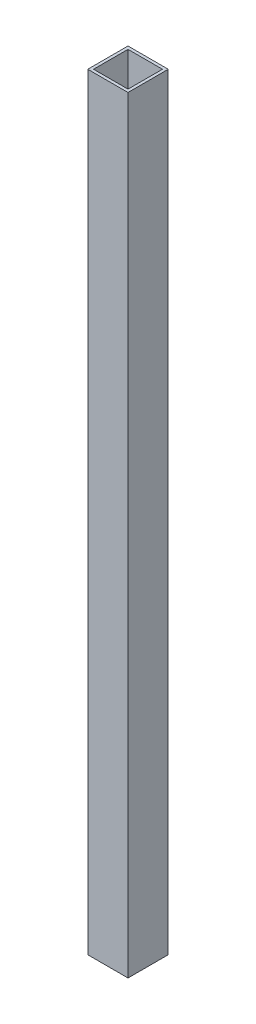
ISO-10303-21;
HEADER;
FILE_DESCRIPTION(('STEP AP214'),'2;1');
FILE_NAME('part.step','',(''),(''),'','','');
FILE_SCHEMA(('AUTOMOTIVE_DESIGN { 1 0 10303 214 1 1 1 1 }'));
ENDSEC;
DATA;
#1=APPLICATION_CONTEXT('core data for automotive mechanical design processes');
#2=APPLICATION_PROTOCOL_DEFINITION('international standard','automotive_design',2000,#1);
#3=PRODUCT_CONTEXT('',#1,'mechanical');
#4=PRODUCT('Part','Part','',(#3));
#5=PRODUCT_RELATED_PRODUCT_CATEGORY('part','',(#4));
#6=PRODUCT_DEFINITION_FORMATION('','',#4);
#7=PRODUCT_DEFINITION_CONTEXT('part definition',#1,'design');
#8=PRODUCT_DEFINITION('design','',#6,#7);
#9=PRODUCT_DEFINITION_SHAPE('','',#8);
#10=(LENGTH_UNIT() NAMED_UNIT(*) SI_UNIT(.MILLI.,.METRE.));
#11=(NAMED_UNIT(*) PLANE_ANGLE_UNIT() SI_UNIT($,.RADIAN.));
#12=(NAMED_UNIT(*) SI_UNIT($,.STERADIAN.) SOLID_ANGLE_UNIT());
#13=UNCERTAINTY_MEASURE_WITH_UNIT(LENGTH_MEASURE(1.E-05),#10,'distance_accuracy_value','');
#14=(GEOMETRIC_REPRESENTATION_CONTEXT(3) GLOBAL_UNCERTAINTY_ASSIGNED_CONTEXT((#13)) GLOBAL_UNIT_ASSIGNED_CONTEXT((#10,
#11,#12)) REPRESENTATION_CONTEXT('',''));
#15=CARTESIAN_POINT('',(0.,0.,0.));
#16=DIRECTION('',(0.,0.,1.));
#17=DIRECTION('',(1.,0.,0.));
#18=AXIS2_PLACEMENT_3D('',#15,#16,#17);
#19=CARTESIAN_POINT('',(401.427112483978,-847.1408,-209.294155168534));
#20=DIRECTION('',(0.,0.,1.));
#21=DIRECTION('',(1.,0.,0.));
#22=AXIS2_PLACEMENT_3D('',#19,#20,#21);
#23=PLANE('',#22);
#24=DIRECTION('',(1.,0.,0.));
#25=VECTOR('',#24,1.);
#26=CARTESIAN_POINT('',(401.427112483978,0.,-209.294155168534));
#27=LINE('',#26,#25);
#28=CARTESIAN_POINT('',(379.202112483979,0.,-209.294155168534));
#29=VERTEX_POINT('',#28);
#30=CARTESIAN_POINT('',(423.652112483979,0.,-209.294155168534));
#31=VERTEX_POINT('',#30);
#32=EDGE_CURVE('E174',#29,#31,#27,.T.);
#33=ORIENTED_EDGE('',*,*,#32,.F.);
#34=DIRECTION('',(0.,1.,0.));
#35=VECTOR('',#34,1.);
#36=CARTESIAN_POINT('',(379.202112483979,-847.1408,-209.294155168534));
#37=LINE('',#36,#35);
#38=CARTESIAN_POINT('',(379.202112483979,-847.1408,-209.294155168534));
#39=VERTEX_POINT('',#38);
#40=EDGE_CURVE('E11',#39,#29,#37,.T.);
#41=ORIENTED_EDGE('',*,*,#40,.F.);
#42=DIRECTION('',(1.,0.,0.));
#43=VECTOR('',#42,1.);
#44=CARTESIAN_POINT('',(401.427112483978,-847.1408,-209.294155168534));
#45=LINE('',#44,#43);
#46=CARTESIAN_POINT('',(423.652112483979,-847.1408,-209.294155168534));
#47=VERTEX_POINT('',#46);
#48=EDGE_CURVE('E127',#39,#47,#45,.T.);
#49=ORIENTED_EDGE('',*,*,#48,.T.);
#50=DIRECTION('',(0.,1.,0.));
#51=VECTOR('',#50,1.);
#52=CARTESIAN_POINT('',(423.652112483979,-847.1408,-209.294155168534));
#53=LINE('',#52,#51);
#54=EDGE_CURVE('E41',#47,#31,#53,.T.);
#55=ORIENTED_EDGE('',*,*,#54,.T.);
#56=EDGE_LOOP('',(#33,#41,#49,#55));
#57=FACE_BOUND('',#56,.T.);
#58=ADVANCED_FACE('F16',(#57),#23,.T.);
#59=CARTESIAN_POINT('',(379.202112483979,-847.1408,-231.519155168534));
#60=DIRECTION('',(1.,0.,0.));
#61=DIRECTION('',(0.,0.,-1.));
#62=AXIS2_PLACEMENT_3D('',#59,#60,#61);
#63=PLANE('',#62);
#64=DIRECTION('',(0.,0.,-1.));
#65=VECTOR('',#64,1.);
#66=CARTESIAN_POINT('',(379.202112483979,0.,-231.519155168534));
#67=LINE('',#66,#65);
#68=CARTESIAN_POINT('',(379.202112483979,0.,-253.744155168534));
#69=VERTEX_POINT('',#68);
#70=EDGE_CURVE('E133',#29,#69,#67,.T.);
#71=ORIENTED_EDGE('',*,*,#70,.T.);
#72=DIRECTION('',(0.,1.,0.));
#73=VECTOR('',#72,1.);
#74=CARTESIAN_POINT('',(379.202112483979,-847.1408,-253.744155168534));
#75=LINE('',#74,#73);
#76=CARTESIAN_POINT('',(379.202112483979,-847.1408,-253.744155168534));
#77=VERTEX_POINT('',#76);
#78=EDGE_CURVE('E27',#77,#69,#75,.T.);
#79=ORIENTED_EDGE('',*,*,#78,.F.);
#80=DIRECTION('',(0.,0.,-1.));
#81=VECTOR('',#80,1.);
#82=CARTESIAN_POINT('',(379.202112483979,-847.1408,-231.519155168534));
#83=LINE('',#82,#81);
#84=EDGE_CURVE('E122',#39,#77,#83,.T.);
#85=ORIENTED_EDGE('',*,*,#84,.F.);
#86=ORIENTED_EDGE('',*,*,#40,.T.);
#87=EDGE_LOOP('',(#71,#79,#85,#86));
#88=FACE_BOUND('',#87,.T.);
#89=ADVANCED_FACE('F131',(#88),#63,.F.);
#90=CARTESIAN_POINT('',(401.427112483978,-847.1408,-253.744155168534));
#91=DIRECTION('',(0.,0.,1.));
#92=DIRECTION('',(1.,0.,0.));
#93=AXIS2_PLACEMENT_3D('',#90,#91,#92);
#94=PLANE('',#93);
#95=DIRECTION('',(1.,0.,0.));
#96=VECTOR('',#95,1.);
#97=CARTESIAN_POINT('',(401.427112483978,0.,-253.744155168534));
#98=LINE('',#97,#96);
#99=CARTESIAN_POINT('',(423.652112483979,0.,-253.744155168534));
#100=VERTEX_POINT('',#99);
#101=EDGE_CURVE('E169',#69,#100,#98,.T.);
#102=ORIENTED_EDGE('',*,*,#101,.T.);
#103=DIRECTION('',(0.,1.,0.));
#104=VECTOR('',#103,1.);
#105=CARTESIAN_POINT('',(423.652112483979,-847.1408,-253.744155168534));
#106=LINE('',#105,#104);
#107=CARTESIAN_POINT('',(423.652112483979,-847.1408,-253.744155168534));
#108=VERTEX_POINT('',#107);
#109=EDGE_CURVE('E75',#108,#100,#106,.T.);
#110=ORIENTED_EDGE('',*,*,#109,.F.);
#111=DIRECTION('',(1.,0.,0.));
#112=VECTOR('',#111,1.);
#113=CARTESIAN_POINT('',(401.427112483978,-847.1408,-253.744155168534));
#114=LINE('',#113,#112);
#115=EDGE_CURVE('E113',#77,#108,#114,.T.);
#116=ORIENTED_EDGE('',*,*,#115,.F.);
#117=ORIENTED_EDGE('',*,*,#78,.T.);
#118=EDGE_LOOP('',(#102,#110,#116,#117));
#119=FACE_BOUND('',#118,.T.);
#120=ADVANCED_FACE('F115',(#119),#94,.F.);
#121=CARTESIAN_POINT('',(382.377112483979,-847.1408,-231.519155168534));
#122=DIRECTION('',(1.,0.,0.));
#123=DIRECTION('',(0.,0.,-1.));
#124=AXIS2_PLACEMENT_3D('',#121,#122,#123);
#125=PLANE('',#124);
#126=DIRECTION('',(0.,0.,-1.));
#127=VECTOR('',#126,1.);
#128=CARTESIAN_POINT('',(382.377112483979,0.,-231.519155168534));
#129=LINE('',#128,#127);
#130=CARTESIAN_POINT('',(382.377112483979,0.,-212.469155168534));
#131=VERTEX_POINT('',#130);
#132=CARTESIAN_POINT('',(382.377112483979,0.,-250.569155168534));
#133=VERTEX_POINT('',#132);
#134=EDGE_CURVE('E186',#131,#133,#129,.T.);
#135=ORIENTED_EDGE('',*,*,#134,.F.);
#136=DIRECTION('',(0.,1.,0.));
#137=VECTOR('',#136,1.);
#138=CARTESIAN_POINT('',(382.377112483979,-847.1408,-212.469155168534));
#139=LINE('',#138,#137);
#140=CARTESIAN_POINT('',(382.377112483979,-847.1408,-212.469155168534));
#141=VERTEX_POINT('',#140);
#142=EDGE_CURVE('E20',#141,#131,#139,.T.);
#143=ORIENTED_EDGE('',*,*,#142,.F.);
#144=DIRECTION('',(0.,0.,-1.));
#145=VECTOR('',#144,1.);
#146=CARTESIAN_POINT('',(382.377112483979,-847.1408,-231.519155168534));
#147=LINE('',#146,#145);
#148=CARTESIAN_POINT('',(382.377112483979,-847.1408,-250.569155168534));
#149=VERTEX_POINT('',#148);
#150=EDGE_CURVE('E168',#141,#149,#147,.T.);
#151=ORIENTED_EDGE('',*,*,#150,.T.);
#152=DIRECTION('',(0.,1.,0.));
#153=VECTOR('',#152,1.);
#154=CARTESIAN_POINT('',(382.377112483979,-847.1408,-250.569155168534));
#155=LINE('',#154,#153);
#156=EDGE_CURVE('E144',#149,#133,#155,.T.);
#157=ORIENTED_EDGE('',*,*,#156,.T.);
#158=EDGE_LOOP('',(#135,#143,#151,#157));
#159=FACE_BOUND('',#158,.T.);
#160=ADVANCED_FACE('F18',(#159),#125,.T.);
#161=CARTESIAN_POINT('',(401.427112483978,-847.1408,-212.469155168534));
#162=DIRECTION('',(0.,0.,1.));
#163=DIRECTION('',(1.,0.,0.));
#164=AXIS2_PLACEMENT_3D('',#161,#162,#163);
#165=PLANE('',#164);
#166=DIRECTION('',(1.,0.,0.));
#167=VECTOR('',#166,1.);
#168=CARTESIAN_POINT('',(401.427112483978,0.,-212.469155168534));
#169=LINE('',#168,#167);
#170=CARTESIAN_POINT('',(420.477112483978,0.,-212.469155168534));
#171=VERTEX_POINT('',#170);
#172=EDGE_CURVE('E183',#131,#171,#169,.T.);
#173=ORIENTED_EDGE('',*,*,#172,.T.);
#174=DIRECTION('',(0.,1.,0.));
#175=VECTOR('',#174,1.);
#176=CARTESIAN_POINT('',(420.477112483978,-847.1408,-212.469155168534));
#177=LINE('',#176,#175);
#178=CARTESIAN_POINT('',(420.477112483978,-847.1408,-212.469155168534));
#179=VERTEX_POINT('',#178);
#180=EDGE_CURVE('E148',#179,#171,#177,.T.);
#181=ORIENTED_EDGE('',*,*,#180,.F.);
#182=DIRECTION('',(1.,0.,0.));
#183=VECTOR('',#182,1.);
#184=CARTESIAN_POINT('',(401.427112483978,-847.1408,-212.469155168534));
#185=LINE('',#184,#183);
#186=EDGE_CURVE('E201',#141,#179,#185,.T.);
#187=ORIENTED_EDGE('',*,*,#186,.F.);
#188=ORIENTED_EDGE('',*,*,#142,.T.);
#189=EDGE_LOOP('',(#173,#181,#187,#188));
#190=FACE_BOUND('',#189,.T.);
#191=ADVANCED_FACE('F216',(#190),#165,.F.);
#192=CARTESIAN_POINT('',(420.477112483978,-847.1408,-231.519155168534));
#193=DIRECTION('',(1.,0.,0.));
#194=DIRECTION('',(0.,0.,-1.));
#195=AXIS2_PLACEMENT_3D('',#192,#193,#194);
#196=PLANE('',#195);
#197=DIRECTION('',(0.,0.,-1.));
#198=VECTOR('',#197,1.);
#199=CARTESIAN_POINT('',(420.477112483978,0.,-231.519155168534));
#200=LINE('',#199,#198);
#201=CARTESIAN_POINT('',(420.477112483978,0.,-250.569155168534));
#202=VERTEX_POINT('',#201);
#203=EDGE_CURVE('E181',#171,#202,#200,.T.);
#204=ORIENTED_EDGE('',*,*,#203,.T.);
#205=DIRECTION('',(0.,1.,0.));
#206=VECTOR('',#205,1.);
#207=CARTESIAN_POINT('',(420.477112483978,-847.1408,-250.569155168534));
#208=LINE('',#207,#206);
#209=CARTESIAN_POINT('',(420.477112483978,-847.1408,-250.569155168534));
#210=VERTEX_POINT('',#209);
#211=EDGE_CURVE('E146',#210,#202,#208,.T.);
#212=ORIENTED_EDGE('',*,*,#211,.F.);
#213=DIRECTION('',(0.,0.,-1.));
#214=VECTOR('',#213,1.);
#215=CARTESIAN_POINT('',(420.477112483978,-847.1408,-231.519155168534));
#216=LINE('',#215,#214);
#217=EDGE_CURVE('E198',#179,#210,#216,.T.);
#218=ORIENTED_EDGE('',*,*,#217,.F.);
#219=ORIENTED_EDGE('',*,*,#180,.T.);
#220=EDGE_LOOP('',(#204,#212,#218,#219));
#221=FACE_BOUND('',#220,.T.);
#222=ADVANCED_FACE('F217',(#221),#196,.F.);
#223=CARTESIAN_POINT('',(401.427112483978,-847.1408,-250.569155168534));
#224=DIRECTION('',(0.,0.,1.));
#225=DIRECTION('',(1.,0.,0.));
#226=AXIS2_PLACEMENT_3D('',#223,#224,#225);
#227=PLANE('',#226);
#228=DIRECTION('',(1.,0.,0.));
#229=VECTOR('',#228,1.);
#230=CARTESIAN_POINT('',(401.427112483978,0.,-250.569155168534));
#231=LINE('',#230,#229);
#232=EDGE_CURVE('E177',#133,#202,#231,.T.);
#233=ORIENTED_EDGE('',*,*,#232,.F.);
#234=ORIENTED_EDGE('',*,*,#156,.F.);
#235=DIRECTION('',(1.,0.,0.));
#236=VECTOR('',#235,1.);
#237=CARTESIAN_POINT('',(401.427112483978,-847.1408,-250.569155168534));
#238=LINE('',#237,#236);
#239=EDGE_CURVE('E194',#149,#210,#238,.T.);
#240=ORIENTED_EDGE('',*,*,#239,.T.);
#241=ORIENTED_EDGE('',*,*,#211,.T.);
#242=EDGE_LOOP('',(#233,#234,#240,#241));
#243=FACE_BOUND('',#242,.T.);
#244=ADVANCED_FACE('F212',(#243),#227,.T.);
#245=CARTESIAN_POINT('',(423.652112483979,-847.1408,-231.519155168534));
#246=DIRECTION('',(1.,0.,0.));
#247=DIRECTION('',(0.,0.,-1.));
#248=AXIS2_PLACEMENT_3D('',#245,#246,#247);
#249=PLANE('',#248);
#250=DIRECTION('',(0.,0.,-1.));
#251=VECTOR('',#250,1.);
#252=CARTESIAN_POINT('',(423.652112483979,0.,-231.519155168534));
#253=LINE('',#252,#251);
#254=EDGE_CURVE('E164',#31,#100,#253,.T.);
#255=ORIENTED_EDGE('',*,*,#254,.F.);
#256=ORIENTED_EDGE('',*,*,#54,.F.);
#257=DIRECTION('',(0.,0.,-1.));
#258=VECTOR('',#257,1.);
#259=CARTESIAN_POINT('',(423.652112483979,-847.1408,-231.519155168534));
#260=LINE('',#259,#258);
#261=EDGE_CURVE('E121',#47,#108,#260,.T.);
#262=ORIENTED_EDGE('',*,*,#261,.T.);
#263=ORIENTED_EDGE('',*,*,#109,.T.);
#264=EDGE_LOOP('',(#255,#256,#262,#263));
#265=FACE_BOUND('',#264,.T.);
#266=ADVANCED_FACE('F225',(#265),#249,.T.);
#267=CARTESIAN_POINT('',(401.427112483978,-847.1408,-231.519155168534));
#268=DIRECTION('',(0.,-1.,0.));
#269=DIRECTION('',(1.,0.,0.));
#270=AXIS2_PLACEMENT_3D('',#267,#268,#269);
#271=PLANE('',#270);
#272=ORIENTED_EDGE('',*,*,#150,.F.);
#273=ORIENTED_EDGE('',*,*,#186,.T.);
#274=ORIENTED_EDGE('',*,*,#217,.T.);
#275=ORIENTED_EDGE('',*,*,#239,.F.);
#276=EDGE_LOOP('',(#272,#273,#274,#275));
#277=FACE_BOUND('',#276,.T.);
#278=ORIENTED_EDGE('',*,*,#48,.F.);
#279=ORIENTED_EDGE('',*,*,#84,.T.);
#280=ORIENTED_EDGE('',*,*,#115,.T.);
#281=ORIENTED_EDGE('',*,*,#261,.F.);
#282=EDGE_LOOP('',(#278,#279,#280,#281));
#283=FACE_BOUND('',#282,.T.);
#284=ADVANCED_FACE('F126',(#277,#283),#271,.T.);
#285=CARTESIAN_POINT('',(401.427112483978,0.,-231.519155168534));
#286=DIRECTION('',(0.,-1.,0.));
#287=DIRECTION('',(1.,0.,0.));
#288=AXIS2_PLACEMENT_3D('',#285,#286,#287);
#289=PLANE('',#288);
#290=ORIENTED_EDGE('',*,*,#134,.T.);
#291=ORIENTED_EDGE('',*,*,#232,.T.);
#292=ORIENTED_EDGE('',*,*,#203,.F.);
#293=ORIENTED_EDGE('',*,*,#172,.F.);
#294=EDGE_LOOP('',(#290,#291,#292,#293));
#295=FACE_BOUND('',#294,.T.);
#296=ORIENTED_EDGE('',*,*,#32,.T.);
#297=ORIENTED_EDGE('',*,*,#254,.T.);
#298=ORIENTED_EDGE('',*,*,#101,.F.);
#299=ORIENTED_EDGE('',*,*,#70,.F.);
#300=EDGE_LOOP('',(#296,#297,#298,#299));
#301=FACE_BOUND('',#300,.T.);
#302=ADVANCED_FACE('F214',(#295,#301),#289,.F.);
#303=CLOSED_SHELL('',(#58,#89,#120,#160,#191,#222,#244,#266,#284,#302));
#304=MANIFOLD_SOLID_BREP('B1',#303);
#305=ADVANCED_BREP_SHAPE_REPRESENTATION('',(#18,#304),#14);
#306=SHAPE_DEFINITION_REPRESENTATION(#9,#305);
ENDSEC;
END-ISO-10303-21;
